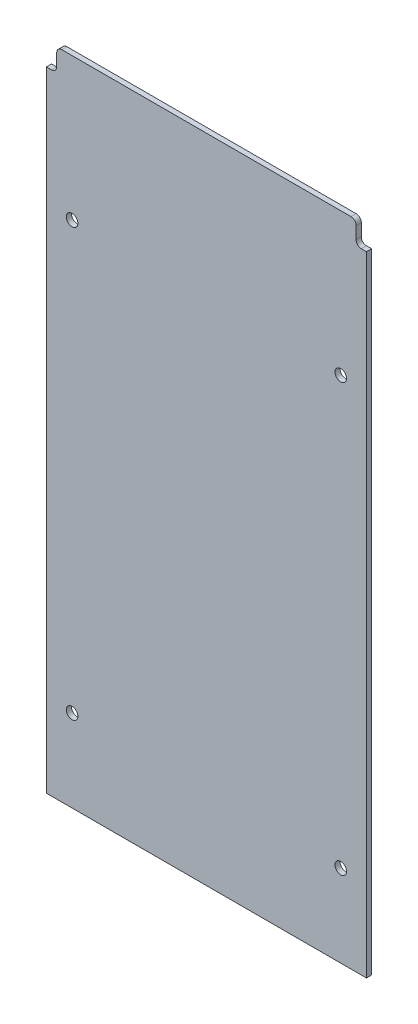
ISO-10303-21;
HEADER;
FILE_DESCRIPTION(('STEP AP214'),'2;1');
FILE_NAME('part.step','',(''),(''),'','','');
FILE_SCHEMA(('AUTOMOTIVE_DESIGN { 1 0 10303 214 1 1 1 1 }'));
ENDSEC;
DATA;
#1=APPLICATION_CONTEXT('core data for automotive mechanical design processes');
#2=APPLICATION_PROTOCOL_DEFINITION('international standard','automotive_design',2000,#1);
#3=PRODUCT_CONTEXT('',#1,'mechanical');
#4=PRODUCT('Part','Part','',(#3));
#5=PRODUCT_RELATED_PRODUCT_CATEGORY('part','',(#4));
#6=PRODUCT_DEFINITION_FORMATION('','',#4);
#7=PRODUCT_DEFINITION_CONTEXT('part definition',#1,'design');
#8=PRODUCT_DEFINITION('design','',#6,#7);
#9=PRODUCT_DEFINITION_SHAPE('','',#8);
#10=(LENGTH_UNIT() NAMED_UNIT(*) SI_UNIT(.MILLI.,.METRE.));
#11=(NAMED_UNIT(*) PLANE_ANGLE_UNIT() SI_UNIT($,.RADIAN.));
#12=(NAMED_UNIT(*) SI_UNIT($,.STERADIAN.) SOLID_ANGLE_UNIT());
#13=UNCERTAINTY_MEASURE_WITH_UNIT(LENGTH_MEASURE(1.E-05),#10,'distance_accuracy_value','');
#14=(GEOMETRIC_REPRESENTATION_CONTEXT(3) GLOBAL_UNCERTAINTY_ASSIGNED_CONTEXT((#13)) GLOBAL_UNIT_ASSIGNED_CONTEXT((#10,
#11,#12)) REPRESENTATION_CONTEXT('',''));
#15=CARTESIAN_POINT('',(0.,0.,0.));
#16=DIRECTION('',(0.,0.,1.));
#17=DIRECTION('',(1.,0.,0.));
#18=AXIS2_PLACEMENT_3D('',#15,#16,#17);
#19=CARTESIAN_POINT('',(281.197049999939,-361.949999999805,3.175));
#20=DIRECTION('',(-1.,0.,0.));
#21=DIRECTION('',(0.,0.,1.));
#22=AXIS2_PLACEMENT_3D('',#19,#20,#21);
#23=PLANE('',#22);
#24=DIRECTION('',(0.,1.,0.));
#25=VECTOR('',#24,1.);
#26=CARTESIAN_POINT('',(281.197049999939,-361.949999999805,0.));
#27=LINE('',#26,#25);
#28=CARTESIAN_POINT('',(281.197049999939,-361.949999999805,0.));
#29=VERTEX_POINT('',#28);
#30=CARTESIAN_POINT('',(281.197049999939,26.3524999954264,0.));
#31=VERTEX_POINT('',#30);
#32=EDGE_CURVE('E140',#29,#31,#27,.T.);
#33=ORIENTED_EDGE('',*,*,#32,.T.);
#34=DIRECTION('',(0.,0.,1.));
#35=VECTOR('',#34,1.);
#36=CARTESIAN_POINT('',(281.197049999939,26.3524999954264,0.));
#37=LINE('',#36,#35);
#38=CARTESIAN_POINT('',(281.197049999939,26.3524999954264,3.175));
#39=VERTEX_POINT('',#38);
#40=EDGE_CURVE('E209',#31,#39,#37,.T.);
#41=ORIENTED_EDGE('',*,*,#40,.T.);
#42=DIRECTION('',(0.,1.,0.));
#43=VECTOR('',#42,1.);
#44=CARTESIAN_POINT('',(281.197049999939,-361.949999999805,3.175));
#45=LINE('',#44,#43);
#46=CARTESIAN_POINT('',(281.197049999939,-361.949999999805,3.175));
#47=VERTEX_POINT('',#46);
#48=EDGE_CURVE('E149',#47,#39,#45,.T.);
#49=ORIENTED_EDGE('',*,*,#48,.F.);
#50=DIRECTION('',(0.,0.,-1.));
#51=VECTOR('',#50,1.);
#52=CARTESIAN_POINT('',(281.197049999939,-361.949999999805,3.175));
#53=LINE('',#52,#51);
#54=EDGE_CURVE('E155',#47,#29,#53,.T.);
#55=ORIENTED_EDGE('',*,*,#54,.T.);
#56=EDGE_LOOP('',(#33,#41,#49,#55));
#57=FACE_BOUND('',#56,.T.);
#58=ADVANCED_FACE('F33',(#57),#23,.F.);
#59=CARTESIAN_POINT('',(281.197049999939,40.3224999954264,3.175));
#60=DIRECTION('',(0.,-1.,0.));
#61=DIRECTION('',(1.,0.,0.));
#62=AXIS2_PLACEMENT_3D('',#59,#60,#61);
#63=PLANE('',#62);
#64=DIRECTION('',(-1.,0.,0.));
#65=VECTOR('',#64,1.);
#66=CARTESIAN_POINT('',(281.197049999939,40.3224999954264,0.));
#67=LINE('',#66,#65);
#68=CARTESIAN_POINT('',(271.672049999939,40.3224999954264,0.));
#69=VERTEX_POINT('',#68);
#70=CARTESIAN_POINT('',(93.1354500000002,40.3224999954264,0.));
#71=VERTEX_POINT('',#70);
#72=EDGE_CURVE('E147',#69,#71,#67,.T.);
#73=ORIENTED_EDGE('',*,*,#72,.T.);
#74=DIRECTION('',(0.,0.,1.));
#75=VECTOR('',#74,1.);
#76=CARTESIAN_POINT('',(93.1354500000002,40.3224999954264,3.175));
#77=LINE('',#76,#75);
#78=CARTESIAN_POINT('',(93.1354500000002,40.3224999954264,3.175));
#79=VERTEX_POINT('',#78);
#80=EDGE_CURVE('E169',#71,#79,#77,.T.);
#81=ORIENTED_EDGE('',*,*,#80,.T.);
#82=DIRECTION('',(-1.,0.,0.));
#83=VECTOR('',#82,1.);
#84=CARTESIAN_POINT('',(281.197049999939,40.3224999954264,3.175));
#85=LINE('',#84,#83);
#86=CARTESIAN_POINT('',(271.672049999939,40.3224999954264,3.175));
#87=VERTEX_POINT('',#86);
#88=EDGE_CURVE('E219',#87,#79,#85,.T.);
#89=ORIENTED_EDGE('',*,*,#88,.F.);
#90=DIRECTION('',(0.,0.,1.));
#91=VECTOR('',#90,1.);
#92=CARTESIAN_POINT('',(271.672049999939,40.3224999954264,3.175));
#93=LINE('',#92,#91);
#94=EDGE_CURVE('E167',#87,#69,#93,.F.);
#95=ORIENTED_EDGE('',*,*,#94,.T.);
#96=EDGE_LOOP('',(#73,#81,#89,#95));
#97=FACE_BOUND('',#96,.T.);
#98=ADVANCED_FACE('F286',(#97),#63,.F.);
#99=CARTESIAN_POINT('',(83.6104500000002,-361.949999999805,3.175));
#100=DIRECTION('',(1.,0.,0.));
#101=DIRECTION('',(0.,0.,-1.));
#102=AXIS2_PLACEMENT_3D('',#99,#100,#101);
#103=PLANE('',#102);
#104=DIRECTION('',(0.,-1.,0.));
#105=VECTOR('',#104,1.);
#106=CARTESIAN_POINT('',(83.6104500000002,-361.949999999805,3.175));
#107=LINE('',#106,#105);
#108=CARTESIAN_POINT('',(83.6104500000002,26.3524999954264,3.175));
#109=VERTEX_POINT('',#108);
#110=CARTESIAN_POINT('',(83.6104500000002,-361.949999999805,3.175));
#111=VERTEX_POINT('',#110);
#112=EDGE_CURVE('E139',#109,#111,#107,.T.);
#113=ORIENTED_EDGE('',*,*,#112,.F.);
#114=DIRECTION('',(0.,0.,1.));
#115=VECTOR('',#114,1.);
#116=CARTESIAN_POINT('',(83.6104500000002,26.3524999954264,0.));
#117=LINE('',#116,#115);
#118=CARTESIAN_POINT('',(83.6104500000002,26.3524999954264,0.));
#119=VERTEX_POINT('',#118);
#120=EDGE_CURVE('E125',#119,#109,#117,.T.);
#121=ORIENTED_EDGE('',*,*,#120,.F.);
#122=DIRECTION('',(0.,-1.,0.));
#123=VECTOR('',#122,1.);
#124=CARTESIAN_POINT('',(83.6104500000002,-361.949999999805,0.));
#125=LINE('',#124,#123);
#126=CARTESIAN_POINT('',(83.6104500000002,-361.949999999805,0.));
#127=VERTEX_POINT('',#126);
#128=EDGE_CURVE('E137',#119,#127,#125,.T.);
#129=ORIENTED_EDGE('',*,*,#128,.T.);
#130=DIRECTION('',(0.,0.,-1.));
#131=VECTOR('',#130,1.);
#132=CARTESIAN_POINT('',(83.6104500000002,-361.949999999805,3.175));
#133=LINE('',#132,#131);
#134=EDGE_CURVE('E158',#111,#127,#133,.T.);
#135=ORIENTED_EDGE('',*,*,#134,.F.);
#136=EDGE_LOOP('',(#113,#121,#129,#135));
#137=FACE_BOUND('',#136,.T.);
#138=ADVANCED_FACE('F135',(#137),#103,.F.);
#139=CARTESIAN_POINT('',(281.197049999939,-361.949999999805,3.175));
#140=DIRECTION('',(0.,1.,0.));
#141=DIRECTION('',(0.,0.,1.));
#142=AXIS2_PLACEMENT_3D('',#139,#140,#141);
#143=PLANE('',#142);
#144=DIRECTION('',(1.,0.,0.));
#145=VECTOR('',#144,1.);
#146=CARTESIAN_POINT('',(281.197049999939,-361.949999999805,0.));
#147=LINE('',#146,#145);
#148=EDGE_CURVE('E146',#127,#29,#147,.T.);
#149=ORIENTED_EDGE('',*,*,#148,.T.);
#150=ORIENTED_EDGE('',*,*,#54,.F.);
#151=DIRECTION('',(1.,0.,0.));
#152=VECTOR('',#151,1.);
#153=CARTESIAN_POINT('',(281.197049999939,-361.949999999805,3.175));
#154=LINE('',#153,#152);
#155=EDGE_CURVE('E159',#111,#47,#154,.T.);
#156=ORIENTED_EDGE('',*,*,#155,.F.);
#157=ORIENTED_EDGE('',*,*,#134,.T.);
#158=EDGE_LOOP('',(#149,#150,#156,#157));
#159=FACE_BOUND('',#158,.T.);
#160=ADVANCED_FACE('F227',(#159),#143,.F.);
#161=CARTESIAN_POINT('',(0.,0.,3.175));
#162=DIRECTION('',(0.,0.,1.));
#163=DIRECTION('',(1.,0.,0.));
#164=AXIS2_PLACEMENT_3D('',#161,#162,#163);
#165=PLANE('',#164);
#166=CARTESIAN_POINT('',(99.4854003074481,-47.6219439182577,3.175));
#167=DIRECTION('',(0.,0.,1.));
#168=DIRECTION('',(1.,0.,0.));
#169=AXIS2_PLACEMENT_3D('',#166,#167,#168);
#170=CIRCLE('',#169,3.57123999999999);
#171=CARTESIAN_POINT('',(103.056640307448,-47.6219439182577,3.175));
#172=VERTEX_POINT('',#171);
#173=EDGE_CURVE('E255',#172,#172,#170,.T.);
#174=ORIENTED_EDGE('',*,*,#173,.F.);
#175=EDGE_LOOP('',(#174));
#176=FACE_BOUND('',#175,.T.);
#177=CARTESIAN_POINT('',(265.322049999961,-47.6250000000233,3.175));
#178=DIRECTION('',(0.,0.,1.));
#179=DIRECTION('',(1.,0.,0.));
#180=AXIS2_PLACEMENT_3D('',#177,#178,#179);
#181=CIRCLE('',#180,3.57123999999998);
#182=CARTESIAN_POINT('',(268.893289999961,-47.6250000000233,3.175));
#183=VERTEX_POINT('',#182);
#184=EDGE_CURVE('E249',#183,#183,#181,.T.);
#185=ORIENTED_EDGE('',*,*,#184,.F.);
#186=EDGE_LOOP('',(#185));
#187=FACE_BOUND('',#186,.T.);
#188=CARTESIAN_POINT('',(265.322050000049,-311.150000000025,3.175));
#189=DIRECTION('',(0.,0.,1.));
#190=DIRECTION('',(1.,0.,0.));
#191=AXIS2_PLACEMENT_3D('',#188,#189,#190);
#192=CIRCLE('',#191,3.57123999999998);
#193=CARTESIAN_POINT('',(268.893290000049,-311.150000000025,3.175));
#194=VERTEX_POINT('',#193);
#195=EDGE_CURVE('E243',#194,#194,#192,.T.);
#196=ORIENTED_EDGE('',*,*,#195,.F.);
#197=EDGE_LOOP('',(#196));
#198=FACE_BOUND('',#197,.T.);
#199=CARTESIAN_POINT('',(99.4854996924384,-311.146943918291,3.175));
#200=DIRECTION('',(0.,0.,1.));
#201=DIRECTION('',(1.,0.,0.));
#202=AXIS2_PLACEMENT_3D('',#199,#200,#201);
#203=CIRCLE('',#202,3.57123999999999);
#204=CARTESIAN_POINT('',(103.056739692438,-311.146943918291,3.175));
#205=VERTEX_POINT('',#204);
#206=EDGE_CURVE('E237',#205,#205,#203,.T.);
#207=ORIENTED_EDGE('',*,*,#206,.F.);
#208=EDGE_LOOP('',(#207));
#209=FACE_BOUND('',#208,.T.);
#210=ORIENTED_EDGE('',*,*,#88,.T.);
#211=CARTESIAN_POINT('',(93.1354500000002,37.1474999954264,3.175));
#212=DIRECTION('',(0.,0.,1.));
#213=DIRECTION('',(1.,0.,0.));
#214=AXIS2_PLACEMENT_3D('',#211,#212,#213);
#215=CIRCLE('',#214,3.175);
#216=CARTESIAN_POINT('',(89.9604500000002,37.1474999954264,3.175));
#217=VERTEX_POINT('',#216);
#218=EDGE_CURVE('E174',#79,#217,#215,.T.);
#219=ORIENTED_EDGE('',*,*,#218,.T.);
#220=DIRECTION('',(0.,1.,0.));
#221=VECTOR('',#220,1.);
#222=CARTESIAN_POINT('',(89.9604500000002,40.3224999954264,3.175));
#223=LINE('',#222,#221);
#224=CARTESIAN_POINT('',(89.9604500000002,29.5274999954264,3.175));
#225=VERTEX_POINT('',#224);
#226=EDGE_CURVE('E213',#225,#217,#223,.T.);
#227=ORIENTED_EDGE('',*,*,#226,.F.);
#228=CARTESIAN_POINT('',(86.7854500000002,29.5274999954264,3.175));
#229=DIRECTION('',(0.,0.,1.));
#230=DIRECTION('',(1.,0.,0.));
#231=AXIS2_PLACEMENT_3D('',#228,#229,#230);
#232=CIRCLE('',#231,3.175);
#233=CARTESIAN_POINT('',(86.7854500000002,26.3524999954264,3.175));
#234=VERTEX_POINT('',#233);
#235=EDGE_CURVE('E187',#225,#234,#232,.F.);
#236=ORIENTED_EDGE('',*,*,#235,.T.);
#237=DIRECTION('',(1.,0.,0.));
#238=VECTOR('',#237,1.);
#239=CARTESIAN_POINT('',(89.9604500000002,26.3524999954264,3.175));
#240=LINE('',#239,#238);
#241=EDGE_CURVE('E228',#109,#234,#240,.T.);
#242=ORIENTED_EDGE('',*,*,#241,.F.);
#243=ORIENTED_EDGE('',*,*,#112,.T.);
#244=ORIENTED_EDGE('',*,*,#155,.T.);
#245=ORIENTED_EDGE('',*,*,#48,.T.);
#246=DIRECTION('',(1.,0.,0.));
#247=VECTOR('',#246,1.);
#248=CARTESIAN_POINT('',(274.847049999939,26.3524999954264,3.175));
#249=LINE('',#248,#247);
#250=CARTESIAN_POINT('',(278.022049999939,26.3524999954264,3.175));
#251=VERTEX_POINT('',#250);
#252=EDGE_CURVE('E197',#251,#39,#249,.T.);
#253=ORIENTED_EDGE('',*,*,#252,.F.);
#254=CARTESIAN_POINT('',(278.022049999939,29.5274999954264,3.175));
#255=DIRECTION('',(0.,0.,1.));
#256=DIRECTION('',(1.,0.,0.));
#257=AXIS2_PLACEMENT_3D('',#254,#255,#256);
#258=CIRCLE('',#257,3.175);
#259=CARTESIAN_POINT('',(274.847049999939,29.5274999954264,3.175));
#260=VERTEX_POINT('',#259);
#261=EDGE_CURVE('E41',#251,#260,#258,.F.);
#262=ORIENTED_EDGE('',*,*,#261,.T.);
#263=DIRECTION('',(0.,-1.,0.));
#264=VECTOR('',#263,1.);
#265=CARTESIAN_POINT('',(274.847049999939,40.3224999954264,3.175));
#266=LINE('',#265,#264);
#267=CARTESIAN_POINT('',(274.847049999939,37.1474999954264,3.175));
#268=VERTEX_POINT('',#267);
#269=EDGE_CURVE('E195',#268,#260,#266,.T.);
#270=ORIENTED_EDGE('',*,*,#269,.F.);
#271=CARTESIAN_POINT('',(271.672049999939,37.1474999954264,3.175));
#272=DIRECTION('',(0.,0.,1.));
#273=DIRECTION('',(1.,0.,0.));
#274=AXIS2_PLACEMENT_3D('',#271,#272,#273);
#275=CIRCLE('',#274,3.175);
#276=EDGE_CURVE('E172',#268,#87,#275,.T.);
#277=ORIENTED_EDGE('',*,*,#276,.T.);
#278=EDGE_LOOP('',(#210,#219,#227,#236,#242,#243,#244,#245,#253,#262,#270,#277));
#279=FACE_BOUND('',#278,.T.);
#280=ADVANCED_FACE('F194',(#176,#187,#198,#209,#279),#165,.T.);
#281=CARTESIAN_POINT('',(0.,0.,0.));
#282=DIRECTION('',(0.,0.,1.));
#283=DIRECTION('',(1.,0.,0.));
#284=AXIS2_PLACEMENT_3D('',#281,#282,#283);
#285=PLANE('',#284);
#286=CARTESIAN_POINT('',(99.4854003074481,-47.6219439182577,0.));
#287=DIRECTION('',(0.,0.,1.));
#288=DIRECTION('',(1.,0.,0.));
#289=AXIS2_PLACEMENT_3D('',#286,#287,#288);
#290=CIRCLE('',#289,3.57124);
#291=CARTESIAN_POINT('',(103.056640307448,-47.6219439182577,0.));
#292=VERTEX_POINT('',#291);
#293=EDGE_CURVE('E252',#292,#292,#290,.T.);
#294=ORIENTED_EDGE('',*,*,#293,.T.);
#295=EDGE_LOOP('',(#294));
#296=FACE_BOUND('',#295,.T.);
#297=CARTESIAN_POINT('',(265.322049999961,-47.6250000000233,0.));
#298=DIRECTION('',(0.,0.,1.));
#299=DIRECTION('',(1.,0.,0.));
#300=AXIS2_PLACEMENT_3D('',#297,#298,#299);
#301=CIRCLE('',#300,3.57123999999998);
#302=CARTESIAN_POINT('',(268.893289999961,-47.6250000000233,0.));
#303=VERTEX_POINT('',#302);
#304=EDGE_CURVE('E246',#303,#303,#301,.T.);
#305=ORIENTED_EDGE('',*,*,#304,.T.);
#306=EDGE_LOOP('',(#305));
#307=FACE_BOUND('',#306,.T.);
#308=CARTESIAN_POINT('',(265.322050000049,-311.150000000025,0.));
#309=DIRECTION('',(0.,0.,1.));
#310=DIRECTION('',(1.,0.,0.));
#311=AXIS2_PLACEMENT_3D('',#308,#309,#310);
#312=CIRCLE('',#311,3.57123999999998);
#313=CARTESIAN_POINT('',(268.893290000049,-311.150000000025,0.));
#314=VERTEX_POINT('',#313);
#315=EDGE_CURVE('E240',#314,#314,#312,.T.);
#316=ORIENTED_EDGE('',*,*,#315,.T.);
#317=EDGE_LOOP('',(#316));
#318=FACE_BOUND('',#317,.T.);
#319=CARTESIAN_POINT('',(99.4854996924384,-311.146943918291,0.));
#320=DIRECTION('',(0.,0.,1.));
#321=DIRECTION('',(1.,0.,0.));
#322=AXIS2_PLACEMENT_3D('',#319,#320,#321);
#323=CIRCLE('',#322,3.57124);
#324=CARTESIAN_POINT('',(103.056739692438,-311.146943918291,0.));
#325=VERTEX_POINT('',#324);
#326=EDGE_CURVE('E202',#325,#325,#323,.T.);
#327=ORIENTED_EDGE('',*,*,#326,.T.);
#328=EDGE_LOOP('',(#327));
#329=FACE_BOUND('',#328,.T.);
#330=DIRECTION('',(0.,1.,0.));
#331=VECTOR('',#330,1.);
#332=CARTESIAN_POINT('',(89.9604500000002,40.3224999954264,0.));
#333=LINE('',#332,#331);
#334=CARTESIAN_POINT('',(89.9604500000002,29.5274999954264,0.));
#335=VERTEX_POINT('',#334);
#336=CARTESIAN_POINT('',(89.9604500000002,37.1474999954264,0.));
#337=VERTEX_POINT('',#336);
#338=EDGE_CURVE('E131',#335,#337,#333,.T.);
#339=ORIENTED_EDGE('',*,*,#338,.T.);
#340=CARTESIAN_POINT('',(93.1354500000002,37.1474999954264,0.));
#341=DIRECTION('',(0.,0.,1.));
#342=DIRECTION('',(1.,0.,0.));
#343=AXIS2_PLACEMENT_3D('',#340,#341,#342);
#344=CIRCLE('',#343,3.175);
#345=EDGE_CURVE('E178',#337,#71,#344,.F.);
#346=ORIENTED_EDGE('',*,*,#345,.T.);
#347=ORIENTED_EDGE('',*,*,#72,.F.);
#348=CARTESIAN_POINT('',(271.672049999939,37.1474999954264,0.));
#349=DIRECTION('',(0.,0.,1.));
#350=DIRECTION('',(1.,0.,0.));
#351=AXIS2_PLACEMENT_3D('',#348,#349,#350);
#352=CIRCLE('',#351,3.175);
#353=CARTESIAN_POINT('',(274.847049999939,37.1474999954264,0.));
#354=VERTEX_POINT('',#353);
#355=EDGE_CURVE('E176',#69,#354,#352,.F.);
#356=ORIENTED_EDGE('',*,*,#355,.T.);
#357=DIRECTION('',(0.,-1.,0.));
#358=VECTOR('',#357,1.);
#359=CARTESIAN_POINT('',(274.847049999939,40.3224999954264,0.));
#360=LINE('',#359,#358);
#361=CARTESIAN_POINT('',(274.847049999939,29.5274999954264,0.));
#362=VERTEX_POINT('',#361);
#363=EDGE_CURVE('E211',#354,#362,#360,.T.);
#364=ORIENTED_EDGE('',*,*,#363,.T.);
#365=CARTESIAN_POINT('',(278.022049999939,29.5274999954264,0.));
#366=DIRECTION('',(0.,0.,1.));
#367=DIRECTION('',(1.,0.,0.));
#368=AXIS2_PLACEMENT_3D('',#365,#366,#367);
#369=CIRCLE('',#368,3.175);
#370=CARTESIAN_POINT('',(278.022049999939,26.3524999954264,0.));
#371=VERTEX_POINT('',#370);
#372=EDGE_CURVE('E11',#362,#371,#369,.T.);
#373=ORIENTED_EDGE('',*,*,#372,.T.);
#374=DIRECTION('',(1.,0.,0.));
#375=VECTOR('',#374,1.);
#376=CARTESIAN_POINT('',(274.847049999939,26.3524999954264,0.));
#377=LINE('',#376,#375);
#378=EDGE_CURVE('E208',#371,#31,#377,.T.);
#379=ORIENTED_EDGE('',*,*,#378,.T.);
#380=ORIENTED_EDGE('',*,*,#32,.F.);
#381=ORIENTED_EDGE('',*,*,#148,.F.);
#382=ORIENTED_EDGE('',*,*,#128,.F.);
#383=DIRECTION('',(1.,0.,0.));
#384=VECTOR('',#383,1.);
#385=CARTESIAN_POINT('',(89.9604500000002,26.3524999954264,0.));
#386=LINE('',#385,#384);
#387=CARTESIAN_POINT('',(86.7854500000002,26.3524999954264,0.));
#388=VERTEX_POINT('',#387);
#389=EDGE_CURVE('E121',#119,#388,#386,.T.);
#390=ORIENTED_EDGE('',*,*,#389,.T.);
#391=CARTESIAN_POINT('',(86.7854500000002,29.5274999954264,0.));
#392=DIRECTION('',(0.,0.,1.));
#393=DIRECTION('',(1.,0.,0.));
#394=AXIS2_PLACEMENT_3D('',#391,#392,#393);
#395=CIRCLE('',#394,3.175);
#396=EDGE_CURVE('E189',#388,#335,#395,.T.);
#397=ORIENTED_EDGE('',*,*,#396,.T.);
#398=EDGE_LOOP('',(#339,#346,#347,#356,#364,#373,#379,#380,#381,#382,#390,#397));
#399=FACE_BOUND('',#398,.T.);
#400=ADVANCED_FACE('F144',(#296,#307,#318,#329,#399),#285,.F.);
#401=CARTESIAN_POINT('',(274.847049999939,40.3224999954264,0.));
#402=DIRECTION('',(-1.,0.,0.));
#403=DIRECTION('',(0.,0.,1.));
#404=AXIS2_PLACEMENT_3D('',#401,#402,#403);
#405=PLANE('',#404);
#406=ORIENTED_EDGE('',*,*,#363,.F.);
#407=DIRECTION('',(0.,0.,1.));
#408=VECTOR('',#407,1.);
#409=CARTESIAN_POINT('',(274.847049999939,37.1474999954264,0.));
#410=LINE('',#409,#408);
#411=EDGE_CURVE('E181',#354,#268,#410,.T.);
#412=ORIENTED_EDGE('',*,*,#411,.T.);
#413=ORIENTED_EDGE('',*,*,#269,.T.);
#414=DIRECTION('',(0.,0.,1.));
#415=VECTOR('',#414,1.);
#416=CARTESIAN_POINT('',(274.847049999939,29.5274999954264,0.));
#417=LINE('',#416,#415);
#418=EDGE_CURVE('E54',#260,#362,#417,.F.);
#419=ORIENTED_EDGE('',*,*,#418,.T.);
#420=EDGE_LOOP('',(#406,#412,#413,#419));
#421=FACE_BOUND('',#420,.T.);
#422=ADVANCED_FACE('F200',(#421),#405,.F.);
#423=CARTESIAN_POINT('',(274.847049999939,26.3524999954264,0.));
#424=DIRECTION('',(0.,-1.,0.));
#425=DIRECTION('',(0.,0.,-1.));
#426=AXIS2_PLACEMENT_3D('',#423,#424,#425);
#427=PLANE('',#426);
#428=ORIENTED_EDGE('',*,*,#378,.F.);
#429=DIRECTION('',(0.,0.,1.));
#430=VECTOR('',#429,1.);
#431=CARTESIAN_POINT('',(278.022049999939,26.3524999954264,3.175));
#432=LINE('',#431,#430);
#433=EDGE_CURVE('E184',#371,#251,#432,.T.);
#434=ORIENTED_EDGE('',*,*,#433,.T.);
#435=ORIENTED_EDGE('',*,*,#252,.T.);
#436=ORIENTED_EDGE('',*,*,#40,.F.);
#437=EDGE_LOOP('',(#428,#434,#435,#436));
#438=FACE_BOUND('',#437,.T.);
#439=ADVANCED_FACE('F205',(#438),#427,.F.);
#440=CARTESIAN_POINT('',(89.9604500000002,40.3224999954264,0.));
#441=DIRECTION('',(1.,0.,0.));
#442=DIRECTION('',(0.,0.,-1.));
#443=AXIS2_PLACEMENT_3D('',#440,#441,#442);
#444=PLANE('',#443);
#445=ORIENTED_EDGE('',*,*,#338,.F.);
#446=DIRECTION('',(0.,0.,1.));
#447=VECTOR('',#446,1.);
#448=CARTESIAN_POINT('',(89.9604500000002,29.5274999954264,3.175));
#449=LINE('',#448,#447);
#450=EDGE_CURVE('E163',#335,#225,#449,.T.);
#451=ORIENTED_EDGE('',*,*,#450,.T.);
#452=ORIENTED_EDGE('',*,*,#226,.T.);
#453=DIRECTION('',(0.,0.,1.));
#454=VECTOR('',#453,1.);
#455=CARTESIAN_POINT('',(89.9604500000002,37.1474999954264,0.));
#456=LINE('',#455,#454);
#457=EDGE_CURVE('E161',#217,#337,#456,.F.);
#458=ORIENTED_EDGE('',*,*,#457,.T.);
#459=EDGE_LOOP('',(#445,#451,#452,#458));
#460=FACE_BOUND('',#459,.T.);
#461=ADVANCED_FACE('F315',(#460),#444,.F.);
#462=CARTESIAN_POINT('',(89.9604500000002,26.3524999954264,0.));
#463=DIRECTION('',(0.,-1.,0.));
#464=DIRECTION('',(0.,0.,-1.));
#465=AXIS2_PLACEMENT_3D('',#462,#463,#464);
#466=PLANE('',#465);
#467=ORIENTED_EDGE('',*,*,#241,.T.);
#468=DIRECTION('',(0.,0.,1.));
#469=VECTOR('',#468,1.);
#470=CARTESIAN_POINT('',(86.7854500000002,26.3524999954264,0.));
#471=LINE('',#470,#469);
#472=EDGE_CURVE('E128',#234,#388,#471,.F.);
#473=ORIENTED_EDGE('',*,*,#472,.T.);
#474=ORIENTED_EDGE('',*,*,#389,.F.);
#475=ORIENTED_EDGE('',*,*,#120,.T.);
#476=EDGE_LOOP('',(#467,#473,#474,#475));
#477=FACE_BOUND('',#476,.T.);
#478=ADVANCED_FACE('F124',(#477),#466,.F.);
#479=CARTESIAN_POINT('',(86.7854500000002,29.5274999954264,0.));
#480=DIRECTION('',(0.,0.,-1.));
#481=DIRECTION('',(-1.,0.,0.));
#482=AXIS2_PLACEMENT_3D('',#479,#480,#481);
#483=CYLINDRICAL_SURFACE('',#482,3.175);
#484=ORIENTED_EDGE('',*,*,#396,.F.);
#485=ORIENTED_EDGE('',*,*,#472,.F.);
#486=ORIENTED_EDGE('',*,*,#235,.F.);
#487=ORIENTED_EDGE('',*,*,#450,.F.);
#488=EDGE_LOOP('',(#484,#485,#486,#487));
#489=FACE_BOUND('',#488,.T.);
#490=ADVANCED_FACE('F295',(#489),#483,.F.);
#491=CARTESIAN_POINT('',(93.1354500000002,37.1474999954264,3.175));
#492=DIRECTION('',(0.,0.,1.));
#493=DIRECTION('',(1.,0.,0.));
#494=AXIS2_PLACEMENT_3D('',#491,#492,#493);
#495=CYLINDRICAL_SURFACE('',#494,3.175);
#496=ORIENTED_EDGE('',*,*,#345,.F.);
#497=ORIENTED_EDGE('',*,*,#457,.F.);
#498=ORIENTED_EDGE('',*,*,#218,.F.);
#499=ORIENTED_EDGE('',*,*,#80,.F.);
#500=EDGE_LOOP('',(#496,#497,#498,#499));
#501=FACE_BOUND('',#500,.T.);
#502=ADVANCED_FACE('F298',(#501),#495,.T.);
#503=CARTESIAN_POINT('',(271.672049999939,37.1474999954264,0.));
#504=DIRECTION('',(0.,0.,1.));
#505=DIRECTION('',(1.,0.,0.));
#506=AXIS2_PLACEMENT_3D('',#503,#504,#505);
#507=CYLINDRICAL_SURFACE('',#506,3.175);
#508=ORIENTED_EDGE('',*,*,#355,.F.);
#509=ORIENTED_EDGE('',*,*,#94,.F.);
#510=ORIENTED_EDGE('',*,*,#276,.F.);
#511=ORIENTED_EDGE('',*,*,#411,.F.);
#512=EDGE_LOOP('',(#508,#509,#510,#511));
#513=FACE_BOUND('',#512,.T.);
#514=ADVANCED_FACE('F282',(#513),#507,.T.);
#515=CARTESIAN_POINT('',(278.022049999939,29.5274999954264,0.));
#516=DIRECTION('',(0.,0.,-1.));
#517=DIRECTION('',(-1.,0.,0.));
#518=AXIS2_PLACEMENT_3D('',#515,#516,#517);
#519=CYLINDRICAL_SURFACE('',#518,3.175);
#520=ORIENTED_EDGE('',*,*,#372,.F.);
#521=ORIENTED_EDGE('',*,*,#418,.F.);
#522=ORIENTED_EDGE('',*,*,#261,.F.);
#523=ORIENTED_EDGE('',*,*,#433,.F.);
#524=EDGE_LOOP('',(#520,#521,#522,#523));
#525=FACE_BOUND('',#524,.T.);
#526=ADVANCED_FACE('F35',(#525),#519,.F.);
#527=CARTESIAN_POINT('',(99.4854996924384,-311.146943918291,3.175));
#528=DIRECTION('',(0.,0.,1.));
#529=DIRECTION('',(1.,0.,0.));
#530=AXIS2_PLACEMENT_3D('',#527,#528,#529);
#531=CYLINDRICAL_SURFACE('',#530,3.57124);
#532=ORIENTED_EDGE('',*,*,#326,.F.);
#533=EDGE_LOOP('',(#532));
#534=FACE_BOUND('',#533,.T.);
#535=ORIENTED_EDGE('',*,*,#206,.T.);
#536=EDGE_LOOP('',(#535));
#537=FACE_BOUND('',#536,.T.);
#538=ADVANCED_FACE('F270',(#534,#537),#531,.F.);
#539=CARTESIAN_POINT('',(265.322050000049,-311.150000000025,3.175));
#540=DIRECTION('',(0.,0.,1.));
#541=DIRECTION('',(1.,0.,0.));
#542=AXIS2_PLACEMENT_3D('',#539,#540,#541);
#543=CYLINDRICAL_SURFACE('',#542,3.57123999999998);
#544=ORIENTED_EDGE('',*,*,#315,.F.);
#545=EDGE_LOOP('',(#544));
#546=FACE_BOUND('',#545,.T.);
#547=ORIENTED_EDGE('',*,*,#195,.T.);
#548=EDGE_LOOP('',(#547));
#549=FACE_BOUND('',#548,.T.);
#550=ADVANCED_FACE('F272',(#546,#549),#543,.F.);
#551=CARTESIAN_POINT('',(265.322049999961,-47.6250000000233,3.175));
#552=DIRECTION('',(0.,0.,1.));
#553=DIRECTION('',(1.,0.,0.));
#554=AXIS2_PLACEMENT_3D('',#551,#552,#553);
#555=CYLINDRICAL_SURFACE('',#554,3.57123999999998);
#556=ORIENTED_EDGE('',*,*,#304,.F.);
#557=EDGE_LOOP('',(#556));
#558=FACE_BOUND('',#557,.T.);
#559=ORIENTED_EDGE('',*,*,#184,.T.);
#560=EDGE_LOOP('',(#559));
#561=FACE_BOUND('',#560,.T.);
#562=ADVANCED_FACE('F279',(#558,#561),#555,.F.);
#563=CARTESIAN_POINT('',(99.4854003074481,-47.6219439182577,3.175));
#564=DIRECTION('',(0.,0.,1.));
#565=DIRECTION('',(1.,0.,0.));
#566=AXIS2_PLACEMENT_3D('',#563,#564,#565);
#567=CYLINDRICAL_SURFACE('',#566,3.57124);
#568=ORIENTED_EDGE('',*,*,#293,.F.);
#569=EDGE_LOOP('',(#568));
#570=FACE_BOUND('',#569,.T.);
#571=ORIENTED_EDGE('',*,*,#173,.T.);
#572=EDGE_LOOP('',(#571));
#573=FACE_BOUND('',#572,.T.);
#574=ADVANCED_FACE('F259',(#570,#573),#567,.F.);
#575=CLOSED_SHELL('',(#58,#98,#138,#160,#280,#400,#422,#439,#461,#478,#490,#502,#514,#526,#538,
#550,#562,#574));
#576=MANIFOLD_SOLID_BREP('B2',#575);
#577=ADVANCED_BREP_SHAPE_REPRESENTATION('',(#18,#576),#14);
#578=SHAPE_DEFINITION_REPRESENTATION(#9,#577);
ENDSEC;
END-ISO-10303-21;
